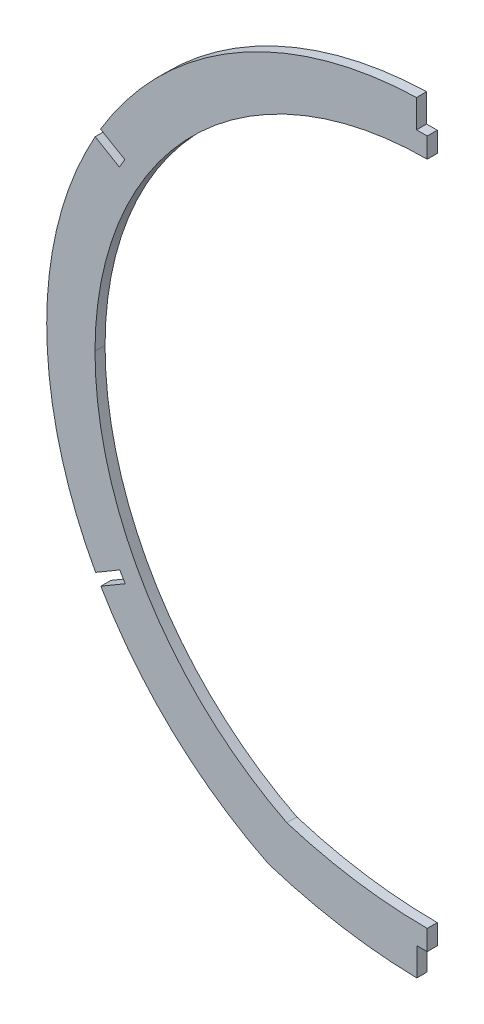
ISO-10303-21;
HEADER;
FILE_DESCRIPTION(('STEP AP214'),'2;1');
FILE_NAME('part.step','',(''),(''),'','','');
FILE_SCHEMA(('AUTOMOTIVE_DESIGN { 1 0 10303 214 1 1 1 1 }'));
ENDSEC;
DATA;
#1=APPLICATION_CONTEXT('core data for automotive mechanical design processes');
#2=APPLICATION_PROTOCOL_DEFINITION('international standard','automotive_design',2000,#1);
#3=PRODUCT_CONTEXT('',#1,'mechanical');
#4=PRODUCT('Part','Part','',(#3));
#5=PRODUCT_RELATED_PRODUCT_CATEGORY('part','',(#4));
#6=PRODUCT_DEFINITION_FORMATION('','',#4);
#7=PRODUCT_DEFINITION_CONTEXT('part definition',#1,'design');
#8=PRODUCT_DEFINITION('design','',#6,#7);
#9=PRODUCT_DEFINITION_SHAPE('','',#8);
#10=(LENGTH_UNIT() NAMED_UNIT(*) SI_UNIT(.MILLI.,.METRE.));
#11=(NAMED_UNIT(*) PLANE_ANGLE_UNIT() SI_UNIT($,.RADIAN.));
#12=(NAMED_UNIT(*) SI_UNIT($,.STERADIAN.) SOLID_ANGLE_UNIT());
#13=UNCERTAINTY_MEASURE_WITH_UNIT(LENGTH_MEASURE(1.E-05),#10,'distance_accuracy_value','');
#14=(GEOMETRIC_REPRESENTATION_CONTEXT(3) GLOBAL_UNCERTAINTY_ASSIGNED_CONTEXT((#13)) GLOBAL_UNIT_ASSIGNED_CONTEXT((#10,
#11,#12)) REPRESENTATION_CONTEXT('',''));
#15=CARTESIAN_POINT('',(0.,0.,0.));
#16=DIRECTION('',(0.,0.,1.));
#17=DIRECTION('',(1.,0.,0.));
#18=AXIS2_PLACEMENT_3D('',#15,#16,#17);
#19=CARTESIAN_POINT('',(2.87745258300709,41.275,1.5875));
#20=DIRECTION('',(0.,0.,1.));
#21=DIRECTION('',(1.,0.,0.));
#22=AXIS2_PLACEMENT_3D('',#19,#20,#21);
#23=PLANE('',#22);
#24=DIRECTION('',(0.,-1.,0.));
#25=VECTOR('',#24,1.);
#26=CARTESIAN_POINT('',(-3.30200000000001,0.,1.5875));
#27=LINE('',#26,#25);
#28=CARTESIAN_POINT('',(-3.30200000000001,-92.624794875824,1.5875));
#29=VERTEX_POINT('',#28);
#30=CARTESIAN_POINT('',(-3.30200000000001,-101.480945567075,1.5875));
#31=VERTEX_POINT('',#30);
#32=EDGE_CURVE('E234',#29,#31,#27,.T.);
#33=ORIENTED_EDGE('',*,*,#32,.F.);
#34=DIRECTION('',(1.,0.,0.));
#35=VECTOR('',#34,1.);
#36=CARTESIAN_POINT('',(0.,-92.624794875824,1.5875));
#37=LINE('',#36,#35);
#38=CARTESIAN_POINT('',(0.,-92.624794875824,1.5875));
#39=VERTEX_POINT('',#38);
#40=EDGE_CURVE('E238',#29,#39,#37,.T.);
#41=ORIENTED_EDGE('',*,*,#40,.T.);
#42=DIRECTION('',(0.,1.,0.));
#43=VECTOR('',#42,1.);
#44=CARTESIAN_POINT('',(0.,41.275,1.5875));
#45=LINE('',#44,#43);
#46=CARTESIAN_POINT('',(0.,-86.2747894878867,1.5875));
#47=VERTEX_POINT('',#46);
#48=EDGE_CURVE('E275',#39,#47,#45,.T.);
#49=ORIENTED_EDGE('',*,*,#48,.T.);
#50=CARTESIAN_POINT('',(0.0401740981522854,63.5,1.5875));
#51=DIRECTION('',(0.,0.,1.));
#52=DIRECTION('',(1.,0.,0.));
#53=AXIS2_PLACEMENT_3D('',#50,#51,#52);
#54=CIRCLE('',#53,149.774794875837);
#55=CARTESIAN_POINT('',(-44.3239593744346,-79.5535313836238,1.5875));
#56=VERTEX_POINT('',#55);
#57=EDGE_CURVE('E280',#56,#47,#54,.T.);
#58=ORIENTED_EDGE('',*,*,#57,.F.);
#59=CARTESIAN_POINT('',(5.71473106786189,19.0500000000001,1.5875));
#60=DIRECTION('',(0.,0.,1.));
#61=DIRECTION('',(1.,0.,0.));
#62=AXIS2_PLACEMENT_3D('',#59,#60,#61);
#63=CIRCLE('',#62,110.573626794554);
#64=CARTESIAN_POINT('',(-104.858895726692,19.05,1.5875));
#65=VERTEX_POINT('',#64);
#66=EDGE_CURVE('E278',#65,#56,#63,.T.);
#67=ORIENTED_EDGE('',*,*,#66,.F.);
#68=CARTESIAN_POINT('',(0.0533981517267298,19.05,1.5875));
#69=DIRECTION('',(0.,0.,1.));
#70=DIRECTION('',(-1.,0.,0.));
#71=AXIS2_PLACEMENT_3D('',#68,#69,#70);
#72=CIRCLE('',#71,104.912293878419);
#73=CARTESIAN_POINT('',(0.,123.962280289149,1.5875));
#74=VERTEX_POINT('',#73);
#75=EDGE_CURVE('E284',#74,#65,#72,.T.);
#76=ORIENTED_EDGE('',*,*,#75,.F.);
#77=CARTESIAN_POINT('',(0.,130.312293878419,1.5875));
#78=VERTEX_POINT('',#77);
#79=EDGE_CURVE('E270',#74,#78,#45,.T.);
#80=ORIENTED_EDGE('',*,*,#79,.T.);
#81=DIRECTION('',(1.,0.,0.));
#82=VECTOR('',#81,1.);
#83=CARTESIAN_POINT('',(0.,130.312293878419,1.5875));
#84=LINE('',#83,#82);
#85=CARTESIAN_POINT('',(-3.3782,130.312293878419,1.5875));
#86=VERTEX_POINT('',#85);
#87=EDGE_CURVE('E198',#86,#78,#84,.T.);
#88=ORIENTED_EDGE('',*,*,#87,.F.);
#89=DIRECTION('',(0.,1.,0.));
#90=VECTOR('',#89,1.);
#91=CARTESIAN_POINT('',(-3.37820000000003,0.,1.5875));
#92=LINE('',#91,#90);
#93=CARTESIAN_POINT('',(-3.3782,139.15327996505,1.5875));
#94=VERTEX_POINT('',#93);
#95=EDGE_CURVE('E179',#86,#94,#92,.T.);
#96=ORIENTED_EDGE('',*,*,#95,.T.);
#97=CARTESIAN_POINT('',(0.0533981517267298,19.05,1.5875));
#98=DIRECTION('',(0.,0.,1.));
#99=DIRECTION('',(-1.,0.,0.));
#100=AXIS2_PLACEMENT_3D('',#97,#98,#99);
#101=CIRCLE('',#100,120.152293878386);
#102=CARTESIAN_POINT('',(-103.109498799884,80.6453765861478,1.5875));
#103=VERTEX_POINT('',#102);
#104=EDGE_CURVE('E309',#94,#103,#101,.T.);
#105=ORIENTED_EDGE('',*,*,#104,.T.);
#106=DIRECTION('',(-0.862448035610578,0.506145617259949,0.));
#107=VECTOR('',#106,1.);
#108=CARTESIAN_POINT('',(8.78872550724226,14.9755698572982,1.5875));
#109=LINE('',#108,#107);
#110=CARTESIAN_POINT('',(-95.4427787347558,76.1460020157409,1.5875));
#111=VERTEX_POINT('',#110);
#112=EDGE_CURVE('E51',#111,#103,#109,.T.);
#113=ORIENTED_EDGE('',*,*,#112,.F.);
#114=DIRECTION('',(-0.50614561725995,-0.862448035610578,0.));
#115=VECTOR('',#114,1.);
#116=CARTESIAN_POINT('',(-104.231504241998,61.1704321584428,1.5875));
#117=LINE('',#116,#115);
#118=CARTESIAN_POINT('',(-97.1526398589833,73.2324800618413,1.5875));
#119=VERTEX_POINT('',#118);
#120=EDGE_CURVE('E206',#111,#119,#117,.T.);
#121=ORIENTED_EDGE('',*,*,#120,.T.);
#122=DIRECTION('',(-0.86244803561058,0.506145617259946,0.));
#123=VECTOR('',#122,1.);
#124=CARTESIAN_POINT('',(7.07886438301491,12.062047903399,1.5875));
#125=LINE('',#124,#123);
#126=CARTESIAN_POINT('',(-104.800401650038,77.7207285737065,1.5875));
#127=VERTEX_POINT('',#126);
#128=EDGE_CURVE('E250',#119,#127,#125,.T.);
#129=ORIENTED_EDGE('',*,*,#128,.T.);
#130=CARTESIAN_POINT('',(-120.098895726659,19.05,1.5875));
#131=VERTEX_POINT('',#130);
#132=EDGE_CURVE('E307',#127,#131,#101,.T.);
#133=ORIENTED_EDGE('',*,*,#132,.T.);
#134=CARTESIAN_POINT('',(5.71473106786189,19.0500000000001,1.5875));
#135=DIRECTION('',(0.,0.,1.));
#136=DIRECTION('',(1.,0.,0.));
#137=AXIS2_PLACEMENT_3D('',#134,#135,#136);
#138=CIRCLE('',#137,125.813626794521);
#139=CARTESIAN_POINT('',(-104.679734985251,-41.3000667111414,1.5875));
#140=VERTEX_POINT('',#139);
#141=EDGE_CURVE('E300',#131,#140,#138,.T.);
#142=ORIENTED_EDGE('',*,*,#141,.T.);
#143=DIRECTION('',(-0.862448043896416,-0.506145603141275,0.));
#144=VECTOR('',#143,1.);
#145=CARTESIAN_POINT('',(-8.78872533830878,14.975570131055,1.5875));
#146=LINE('',#145,#144);
#147=CARTESIAN_POINT('',(-97.0449544512489,-36.8194366887515,1.5875));
#148=VERTEX_POINT('',#147);
#149=EDGE_CURVE('E59',#148,#140,#146,.T.);
#150=ORIENTED_EDGE('',*,*,#149,.F.);
#151=DIRECTION('',(-0.506145603141261,0.862448043896425,0.));
#152=VECTOR('',#151,1.);
#153=CARTESIAN_POINT('',(-88.2562291129412,-51.7950068198052,1.5875));
#154=LINE('',#153,#152);
#155=CARTESIAN_POINT('',(-95.3350933747171,-39.7329586706424,1.5875));
#156=VERTEX_POINT('',#155);
#157=EDGE_CURVE('E220',#156,#148,#154,.T.);
#158=ORIENTED_EDGE('',*,*,#157,.F.);
#159=DIRECTION('',(-0.862448043896416,-0.506145603141276,0.));
#160=VECTOR('',#159,1.);
#161=CARTESIAN_POINT('',(-7.078864261777,12.0620481491642,1.5875));
#162=LINE('',#161,#160);
#163=CARTESIAN_POINT('',(-103.019390963811,-44.2426488084706,1.5875));
#164=VERTEX_POINT('',#163);
#165=EDGE_CURVE('E217',#156,#164,#162,.T.);
#166=ORIENTED_EDGE('',*,*,#165,.T.);
#167=CARTESIAN_POINT('',(-50.0584032460589,-93.7259999999829,1.5875));
#168=VERTEX_POINT('',#167);
#169=EDGE_CURVE('E304',#164,#168,#138,.T.);
#170=ORIENTED_EDGE('',*,*,#169,.T.);
#171=CARTESIAN_POINT('',(0.0401740981522854,63.5,1.5875));
#172=DIRECTION('',(0.,0.,1.));
#173=DIRECTION('',(1.,0.,0.));
#174=AXIS2_PLACEMENT_3D('',#171,#172,#173);
#175=CIRCLE('',#174,165.014794875819);
#176=EDGE_CURVE('E303',#168,#31,#175,.T.);
#177=ORIENTED_EDGE('',*,*,#176,.T.);
#178=EDGE_LOOP('',(#33,#41,#49,#58,#67,#76,#80,#88,#96,#105,#113,#121,#129,#133,#142,#150,#158,
#166,#170,#177));
#179=FACE_BOUND('',#178,.T.);
#180=ADVANCED_FACE('F36',(#179),#23,.T.);
#181=CARTESIAN_POINT('',(2.87745258300709,41.275,-1.5875));
#182=DIRECTION('',(0.,0.,1.));
#183=DIRECTION('',(1.,0.,0.));
#184=AXIS2_PLACEMENT_3D('',#181,#182,#183);
#185=PLANE('',#184);
#186=DIRECTION('',(1.,0.,0.));
#187=VECTOR('',#186,1.);
#188=CARTESIAN_POINT('',(0.,-92.624794875824,-1.5875));
#189=LINE('',#188,#187);
#190=CARTESIAN_POINT('',(-3.30200000000001,-92.624794875824,-1.5875));
#191=VERTEX_POINT('',#190);
#192=CARTESIAN_POINT('',(0.,-92.624794875824,-1.5875));
#193=VERTEX_POINT('',#192);
#194=EDGE_CURVE('E231',#191,#193,#189,.T.);
#195=ORIENTED_EDGE('',*,*,#194,.F.);
#196=DIRECTION('',(0.,-1.,0.));
#197=VECTOR('',#196,1.);
#198=CARTESIAN_POINT('',(-3.30200000000001,0.,-1.5875));
#199=LINE('',#198,#197);
#200=CARTESIAN_POINT('',(-3.30200000000001,-101.480945567075,-1.5875));
#201=VERTEX_POINT('',#200);
#202=EDGE_CURVE('E233',#191,#201,#199,.T.);
#203=ORIENTED_EDGE('',*,*,#202,.T.);
#204=CARTESIAN_POINT('',(0.0401740981522854,63.5,-1.5875));
#205=DIRECTION('',(0.,0.,1.));
#206=DIRECTION('',(1.,0.,0.));
#207=AXIS2_PLACEMENT_3D('',#204,#205,#206);
#208=CIRCLE('',#207,165.014794875819);
#209=CARTESIAN_POINT('',(-50.0584032460589,-93.7259999999829,-1.5875));
#210=VERTEX_POINT('',#209);
#211=EDGE_CURVE('E313',#210,#201,#208,.T.);
#212=ORIENTED_EDGE('',*,*,#211,.F.);
#213=CARTESIAN_POINT('',(5.71473106786189,19.0500000000001,-1.5875));
#214=DIRECTION('',(0.,0.,1.));
#215=DIRECTION('',(1.,0.,0.));
#216=AXIS2_PLACEMENT_3D('',#213,#214,#215);
#217=CIRCLE('',#216,125.813626794521);
#218=CARTESIAN_POINT('',(-103.019390963811,-44.2426488084706,-1.5875));
#219=VERTEX_POINT('',#218);
#220=EDGE_CURVE('E299',#219,#210,#217,.T.);
#221=ORIENTED_EDGE('',*,*,#220,.F.);
#222=DIRECTION('',(-0.862448043896416,-0.506145603141276,0.));
#223=VECTOR('',#222,1.);
#224=CARTESIAN_POINT('',(-7.078864261777,12.0620481491642,-1.5875));
#225=LINE('',#224,#223);
#226=CARTESIAN_POINT('',(-95.3350933747171,-39.7329586706424,-1.5875));
#227=VERTEX_POINT('',#226);
#228=EDGE_CURVE('E208',#227,#219,#225,.T.);
#229=ORIENTED_EDGE('',*,*,#228,.F.);
#230=DIRECTION('',(-0.506145603141261,0.862448043896425,0.));
#231=VECTOR('',#230,1.);
#232=CARTESIAN_POINT('',(-88.2562291129412,-51.7950068198052,-1.5875));
#233=LINE('',#232,#231);
#234=CARTESIAN_POINT('',(-97.0449544512489,-36.8194366887515,-1.5875));
#235=VERTEX_POINT('',#234);
#236=EDGE_CURVE('E210',#227,#235,#233,.T.);
#237=ORIENTED_EDGE('',*,*,#236,.T.);
#238=DIRECTION('',(-0.862448043896416,-0.506145603141275,0.));
#239=VECTOR('',#238,1.);
#240=CARTESIAN_POINT('',(-8.78872533830878,14.975570131055,-1.5875));
#241=LINE('',#240,#239);
#242=CARTESIAN_POINT('',(-104.679734985251,-41.3000667111414,-1.5875));
#243=VERTEX_POINT('',#242);
#244=EDGE_CURVE('E213',#235,#243,#241,.T.);
#245=ORIENTED_EDGE('',*,*,#244,.T.);
#246=CARTESIAN_POINT('',(-120.098895726659,19.05,-1.5875));
#247=VERTEX_POINT('',#246);
#248=EDGE_CURVE('E310',#247,#243,#217,.T.);
#249=ORIENTED_EDGE('',*,*,#248,.F.);
#250=CARTESIAN_POINT('',(0.0533981517267298,19.05,-1.5875));
#251=DIRECTION('',(0.,0.,1.));
#252=DIRECTION('',(-1.,0.,0.));
#253=AXIS2_PLACEMENT_3D('',#250,#251,#252);
#254=CIRCLE('',#253,120.152293878386);
#255=CARTESIAN_POINT('',(-104.800401650038,77.7207285737065,-1.5875));
#256=VERTEX_POINT('',#255);
#257=EDGE_CURVE('E316',#256,#247,#254,.T.);
#258=ORIENTED_EDGE('',*,*,#257,.F.);
#259=DIRECTION('',(-0.86244803561058,0.506145617259946,0.));
#260=VECTOR('',#259,1.);
#261=CARTESIAN_POINT('',(7.07886438301491,12.062047903399,-1.5875));
#262=LINE('',#261,#260);
#263=CARTESIAN_POINT('',(-97.1526398589833,73.2324800618413,-1.5875));
#264=VERTEX_POINT('',#263);
#265=EDGE_CURVE('E252',#264,#256,#262,.T.);
#266=ORIENTED_EDGE('',*,*,#265,.F.);
#267=DIRECTION('',(-0.50614561725995,-0.862448035610578,0.));
#268=VECTOR('',#267,1.);
#269=CARTESIAN_POINT('',(-104.231504241998,61.1704321584428,-1.5875));
#270=LINE('',#269,#268);
#271=CARTESIAN_POINT('',(-95.4427787347558,76.1460020157409,-1.5875));
#272=VERTEX_POINT('',#271);
#273=EDGE_CURVE('E247',#272,#264,#270,.T.);
#274=ORIENTED_EDGE('',*,*,#273,.F.);
#275=DIRECTION('',(-0.862448035610578,0.506145617259949,0.));
#276=VECTOR('',#275,1.);
#277=CARTESIAN_POINT('',(8.78872550724226,14.9755698572982,-1.5875));
#278=LINE('',#277,#276);
#279=CARTESIAN_POINT('',(-103.109498799884,80.6453765861478,-1.5875));
#280=VERTEX_POINT('',#279);
#281=EDGE_CURVE('E249',#272,#280,#278,.T.);
#282=ORIENTED_EDGE('',*,*,#281,.T.);
#283=CARTESIAN_POINT('',(-3.3782,139.15327996505,-1.5875));
#284=VERTEX_POINT('',#283);
#285=EDGE_CURVE('E197',#284,#280,#254,.T.);
#286=ORIENTED_EDGE('',*,*,#285,.F.);
#287=DIRECTION('',(0.,1.,0.));
#288=VECTOR('',#287,1.);
#289=CARTESIAN_POINT('',(-3.37820000000003,0.,-1.5875));
#290=LINE('',#289,#288);
#291=CARTESIAN_POINT('',(-3.3782,130.312293878419,-1.5875));
#292=VERTEX_POINT('',#291);
#293=EDGE_CURVE('E176',#292,#284,#290,.T.);
#294=ORIENTED_EDGE('',*,*,#293,.F.);
#295=DIRECTION('',(1.,0.,0.));
#296=VECTOR('',#295,1.);
#297=CARTESIAN_POINT('',(0.,130.312293878419,-1.5875));
#298=LINE('',#297,#296);
#299=CARTESIAN_POINT('',(0.,130.312293878419,-1.5875));
#300=VERTEX_POINT('',#299);
#301=EDGE_CURVE('E183',#292,#300,#298,.T.);
#302=ORIENTED_EDGE('',*,*,#301,.T.);
#303=DIRECTION('',(0.,1.,0.));
#304=VECTOR('',#303,1.);
#305=CARTESIAN_POINT('',(0.,41.275,-1.5875));
#306=LINE('',#305,#304);
#307=CARTESIAN_POINT('',(0.,123.962280289149,-1.5875));
#308=VERTEX_POINT('',#307);
#309=EDGE_CURVE('E263',#308,#300,#306,.T.);
#310=ORIENTED_EDGE('',*,*,#309,.F.);
#311=CARTESIAN_POINT('',(0.0533981517267298,19.05,-1.5875));
#312=DIRECTION('',(0.,0.,1.));
#313=DIRECTION('',(-1.,0.,0.));
#314=AXIS2_PLACEMENT_3D('',#311,#312,#313);
#315=CIRCLE('',#314,104.912293878419);
#316=CARTESIAN_POINT('',(-104.858895726692,19.05,-1.5875));
#317=VERTEX_POINT('',#316);
#318=EDGE_CURVE('E281',#308,#317,#315,.T.);
#319=ORIENTED_EDGE('',*,*,#318,.T.);
#320=CARTESIAN_POINT('',(5.71473106786189,19.0500000000001,-1.5875));
#321=DIRECTION('',(0.,0.,1.));
#322=DIRECTION('',(1.,0.,0.));
#323=AXIS2_PLACEMENT_3D('',#320,#321,#322);
#324=CIRCLE('',#323,110.573626794554);
#325=CARTESIAN_POINT('',(-44.3239593744346,-79.5535313836238,-1.5875));
#326=VERTEX_POINT('',#325);
#327=EDGE_CURVE('E287',#317,#326,#324,.T.);
#328=ORIENTED_EDGE('',*,*,#327,.T.);
#329=CARTESIAN_POINT('',(0.0401740981522854,63.5,-1.5875));
#330=DIRECTION('',(0.,0.,1.));
#331=DIRECTION('',(1.,0.,0.));
#332=AXIS2_PLACEMENT_3D('',#329,#330,#331);
#333=CIRCLE('',#332,149.774794875837);
#334=CARTESIAN_POINT('',(0.,-86.2747894878867,-1.5875));
#335=VERTEX_POINT('',#334);
#336=EDGE_CURVE('E290',#326,#335,#333,.T.);
#337=ORIENTED_EDGE('',*,*,#336,.T.);
#338=EDGE_CURVE('E271',#193,#335,#306,.T.);
#339=ORIENTED_EDGE('',*,*,#338,.F.);
#340=EDGE_LOOP('',(#195,#203,#212,#221,#229,#237,#245,#249,#258,#266,#274,#282,#286,#294,#302,
#310,#319,#328,#337,#339));
#341=FACE_BOUND('',#340,.T.);
#342=ADVANCED_FACE('F194',(#341),#185,.F.);
#343=CARTESIAN_POINT('',(0.0533981517267298,19.05,1.5875));
#344=DIRECTION('',(0.,0.,-1.));
#345=DIRECTION('',(-1.,0.,0.));
#346=AXIS2_PLACEMENT_3D('',#343,#344,#345);
#347=CYLINDRICAL_SURFACE('',#346,120.152293878386);
#348=DIRECTION('',(0.,0.,1.));
#349=VECTOR('',#348,1.);
#350=CARTESIAN_POINT('',(-3.3782,139.15327996505,-1.5875));
#351=LINE('',#350,#349);
#352=EDGE_CURVE('E204',#284,#94,#351,.T.);
#353=ORIENTED_EDGE('',*,*,#352,.F.);
#354=ORIENTED_EDGE('',*,*,#285,.T.);
#355=DIRECTION('',(0.,0.,1.));
#356=VECTOR('',#355,1.);
#357=CARTESIAN_POINT('',(-103.109498799884,80.6453765861478,-1.5875));
#358=LINE('',#357,#356);
#359=EDGE_CURVE('E266',#280,#103,#358,.T.);
#360=ORIENTED_EDGE('',*,*,#359,.T.);
#361=ORIENTED_EDGE('',*,*,#104,.F.);
#362=EDGE_LOOP('',(#353,#354,#360,#361));
#363=FACE_BOUND('',#362,.T.);
#364=ADVANCED_FACE('F342',(#363),#347,.T.);
#365=DIRECTION('',(0.,0.,1.));
#366=VECTOR('',#365,1.);
#367=CARTESIAN_POINT('',(-104.800401650038,77.7207285737065,-1.5875));
#368=LINE('',#367,#366);
#369=EDGE_CURVE('E264',#256,#127,#368,.T.);
#370=ORIENTED_EDGE('',*,*,#369,.F.);
#371=ORIENTED_EDGE('',*,*,#257,.T.);
#372=DIRECTION('',(0.,0.,-1.));
#373=VECTOR('',#372,1.);
#374=CARTESIAN_POINT('',(-120.098895726659,19.05,1.5875));
#375=LINE('',#374,#373);
#376=EDGE_CURVE('E318',#131,#247,#375,.T.);
#377=ORIENTED_EDGE('',*,*,#376,.F.);
#378=ORIENTED_EDGE('',*,*,#132,.F.);
#379=EDGE_LOOP('',(#370,#371,#377,#378));
#380=FACE_BOUND('',#379,.T.);
#381=ADVANCED_FACE('F386',(#380),#347,.T.);
#382=CARTESIAN_POINT('',(5.71473106786189,19.0500000000001,1.5875));
#383=DIRECTION('',(0.,0.,-1.));
#384=DIRECTION('',(-1.,0.,0.));
#385=AXIS2_PLACEMENT_3D('',#382,#383,#384);
#386=CYLINDRICAL_SURFACE('',#385,125.813626794521);
#387=DIRECTION('',(0.,0.,1.));
#388=VECTOR('',#387,1.);
#389=CARTESIAN_POINT('',(-103.019390963811,-44.2426488084706,-1.5875));
#390=LINE('',#389,#388);
#391=EDGE_CURVE('E202',#219,#164,#390,.T.);
#392=ORIENTED_EDGE('',*,*,#391,.F.);
#393=ORIENTED_EDGE('',*,*,#220,.T.);
#394=DIRECTION('',(0.,0.,-1.));
#395=VECTOR('',#394,1.);
#396=CARTESIAN_POINT('',(-50.0584032460589,-93.7259999999829,1.5875));
#397=LINE('',#396,#395);
#398=EDGE_CURVE('E44',#168,#210,#397,.T.);
#399=ORIENTED_EDGE('',*,*,#398,.F.);
#400=ORIENTED_EDGE('',*,*,#169,.F.);
#401=EDGE_LOOP('',(#392,#393,#399,#400));
#402=FACE_BOUND('',#401,.T.);
#403=ADVANCED_FACE('F329',(#402),#386,.T.);
#404=CARTESIAN_POINT('',(0.,0.,0.));
#405=DIRECTION('',(1.,0.,0.));
#406=DIRECTION('',(0.,0.,-1.));
#407=AXIS2_PLACEMENT_3D('',#404,#405,#406);
#408=PLANE('',#407);
#409=ORIENTED_EDGE('',*,*,#48,.F.);
#410=DIRECTION('',(0.,0.,1.));
#411=VECTOR('',#410,1.);
#412=CARTESIAN_POINT('',(0.,-92.624794875824,-1.5875));
#413=LINE('',#412,#411);
#414=EDGE_CURVE('E221',#193,#39,#413,.T.);
#415=ORIENTED_EDGE('',*,*,#414,.F.);
#416=ORIENTED_EDGE('',*,*,#338,.T.);
#417=DIRECTION('',(0.,0.,-1.));
#418=VECTOR('',#417,1.);
#419=CARTESIAN_POINT('',(0.,-86.2747894878867,1.5875));
#420=LINE('',#419,#418);
#421=EDGE_CURVE('E274',#47,#335,#420,.T.);
#422=ORIENTED_EDGE('',*,*,#421,.F.);
#423=EDGE_LOOP('',(#409,#415,#416,#422));
#424=FACE_BOUND('',#423,.T.);
#425=ADVANCED_FACE('F364',(#424),#408,.T.);
#426=CARTESIAN_POINT('',(0.0401740981522854,63.5,1.5875));
#427=DIRECTION('',(0.,0.,-1.));
#428=DIRECTION('',(-1.,0.,0.));
#429=AXIS2_PLACEMENT_3D('',#426,#427,#428);
#430=CYLINDRICAL_SURFACE('',#429,165.014794875819);
#431=ORIENTED_EDGE('',*,*,#211,.T.);
#432=DIRECTION('',(0.,0.,1.));
#433=VECTOR('',#432,1.);
#434=CARTESIAN_POINT('',(-3.30200000000001,-101.480945567075,-1.5875));
#435=LINE('',#434,#433);
#436=EDGE_CURVE('E243',#201,#31,#435,.T.);
#437=ORIENTED_EDGE('',*,*,#436,.T.);
#438=ORIENTED_EDGE('',*,*,#176,.F.);
#439=ORIENTED_EDGE('',*,*,#398,.T.);
#440=EDGE_LOOP('',(#431,#437,#438,#439));
#441=FACE_BOUND('',#440,.T.);
#442=ADVANCED_FACE('F324',(#441),#430,.T.);
#443=CARTESIAN_POINT('',(0.0401740981522854,63.5,1.5875));
#444=DIRECTION('',(0.,0.,-1.));
#445=DIRECTION('',(-1.,0.,0.));
#446=AXIS2_PLACEMENT_3D('',#443,#444,#445);
#447=CYLINDRICAL_SURFACE('',#446,149.774794875837);
#448=ORIENTED_EDGE('',*,*,#57,.T.);
#449=ORIENTED_EDGE('',*,*,#421,.T.);
#450=ORIENTED_EDGE('',*,*,#336,.F.);
#451=DIRECTION('',(0.,0.,-1.));
#452=VECTOR('',#451,1.);
#453=CARTESIAN_POINT('',(-44.3239593744346,-79.5535313836238,1.5875));
#454=LINE('',#453,#452);
#455=EDGE_CURVE('E296',#56,#326,#454,.T.);
#456=ORIENTED_EDGE('',*,*,#455,.F.);
#457=EDGE_LOOP('',(#448,#449,#450,#456));
#458=FACE_BOUND('',#457,.T.);
#459=ADVANCED_FACE('F361',(#458),#447,.F.);
#460=CARTESIAN_POINT('',(0.0533981517267298,19.05,1.5875));
#461=DIRECTION('',(0.,0.,-1.));
#462=DIRECTION('',(-1.,0.,0.));
#463=AXIS2_PLACEMENT_3D('',#460,#461,#462);
#464=CYLINDRICAL_SURFACE('',#463,104.912293878419);
#465=ORIENTED_EDGE('',*,*,#318,.F.);
#466=DIRECTION('',(0.,0.,-1.));
#467=VECTOR('',#466,1.);
#468=CARTESIAN_POINT('',(0.,123.962280289149,1.5875));
#469=LINE('',#468,#467);
#470=EDGE_CURVE('E11',#308,#74,#469,.F.);
#471=ORIENTED_EDGE('',*,*,#470,.T.);
#472=ORIENTED_EDGE('',*,*,#75,.T.);
#473=DIRECTION('',(0.,0.,-1.));
#474=VECTOR('',#473,1.);
#475=CARTESIAN_POINT('',(-104.858895726692,19.05,1.5875));
#476=LINE('',#475,#474);
#477=EDGE_CURVE('E286',#65,#317,#476,.T.);
#478=ORIENTED_EDGE('',*,*,#477,.T.);
#479=EDGE_LOOP('',(#465,#471,#472,#478));
#480=FACE_BOUND('',#479,.T.);
#481=ADVANCED_FACE('F351',(#480),#464,.F.);
#482=ORIENTED_EDGE('',*,*,#248,.T.);
#483=DIRECTION('',(0.,0.,1.));
#484=VECTOR('',#483,1.);
#485=CARTESIAN_POINT('',(-104.679734985251,-41.3000667111414,-1.5875));
#486=LINE('',#485,#484);
#487=EDGE_CURVE('E226',#243,#140,#486,.T.);
#488=ORIENTED_EDGE('',*,*,#487,.T.);
#489=ORIENTED_EDGE('',*,*,#141,.F.);
#490=ORIENTED_EDGE('',*,*,#376,.T.);
#491=EDGE_LOOP('',(#482,#488,#489,#490));
#492=FACE_BOUND('',#491,.T.);
#493=ADVANCED_FACE('F38',(#492),#386,.T.);
#494=CARTESIAN_POINT('',(5.71473106786189,19.0500000000001,1.5875));
#495=DIRECTION('',(0.,0.,-1.));
#496=DIRECTION('',(-1.,0.,0.));
#497=AXIS2_PLACEMENT_3D('',#494,#495,#496);
#498=CYLINDRICAL_SURFACE('',#497,110.573626794554);
#499=ORIENTED_EDGE('',*,*,#327,.F.);
#500=ORIENTED_EDGE('',*,*,#477,.F.);
#501=ORIENTED_EDGE('',*,*,#66,.T.);
#502=ORIENTED_EDGE('',*,*,#455,.T.);
#503=EDGE_LOOP('',(#499,#500,#501,#502));
#504=FACE_BOUND('',#503,.T.);
#505=ADVANCED_FACE('F355',(#504),#498,.F.);
#506=DIRECTION('',(0.,0.,1.));
#507=VECTOR('',#506,1.);
#508=CARTESIAN_POINT('',(0.,130.312293878419,-1.5875));
#509=LINE('',#508,#507);
#510=EDGE_CURVE('E182',#300,#78,#509,.T.);
#511=ORIENTED_EDGE('',*,*,#510,.T.);
#512=ORIENTED_EDGE('',*,*,#79,.F.);
#513=ORIENTED_EDGE('',*,*,#470,.F.);
#514=ORIENTED_EDGE('',*,*,#309,.T.);
#515=EDGE_LOOP('',(#511,#512,#513,#514));
#516=FACE_BOUND('',#515,.T.);
#517=ADVANCED_FACE('F347',(#516),#408,.T.);
#518=CARTESIAN_POINT('',(0.,-92.624794875824,-1.5875));
#519=DIRECTION('',(0.,-1.,0.));
#520=DIRECTION('',(0.,0.,-1.));
#521=AXIS2_PLACEMENT_3D('',#518,#519,#520);
#522=PLANE('',#521);
#523=ORIENTED_EDGE('',*,*,#40,.F.);
#524=DIRECTION('',(0.,0.,1.));
#525=VECTOR('',#524,1.);
#526=CARTESIAN_POINT('',(-3.30200000000001,-92.624794875824,-1.5875));
#527=LINE('',#526,#525);
#528=EDGE_CURVE('E237',#191,#29,#527,.T.);
#529=ORIENTED_EDGE('',*,*,#528,.F.);
#530=ORIENTED_EDGE('',*,*,#194,.T.);
#531=ORIENTED_EDGE('',*,*,#414,.T.);
#532=EDGE_LOOP('',(#523,#529,#530,#531));
#533=FACE_BOUND('',#532,.T.);
#534=ADVANCED_FACE('F366',(#533),#522,.T.);
#535=CARTESIAN_POINT('',(-3.30200000000001,0.,-1.5875));
#536=DIRECTION('',(-1.,0.,0.));
#537=DIRECTION('',(0.,-1.,0.));
#538=AXIS2_PLACEMENT_3D('',#535,#536,#537);
#539=PLANE('',#538);
#540=ORIENTED_EDGE('',*,*,#32,.T.);
#541=ORIENTED_EDGE('',*,*,#436,.F.);
#542=ORIENTED_EDGE('',*,*,#202,.F.);
#543=ORIENTED_EDGE('',*,*,#528,.T.);
#544=EDGE_LOOP('',(#540,#541,#542,#543));
#545=FACE_BOUND('',#544,.T.);
#546=ADVANCED_FACE('F335',(#545),#539,.F.);
#547=CARTESIAN_POINT('',(-3.37820000000003,0.,-1.5875));
#548=DIRECTION('',(1.,0.,0.));
#549=DIRECTION('',(0.,1.,0.));
#550=AXIS2_PLACEMENT_3D('',#547,#548,#549);
#551=PLANE('',#550);
#552=ORIENTED_EDGE('',*,*,#95,.F.);
#553=DIRECTION('',(0.,0.,1.));
#554=VECTOR('',#553,1.);
#555=CARTESIAN_POINT('',(-3.3782,130.312293878419,-1.5875));
#556=LINE('',#555,#554);
#557=EDGE_CURVE('E172',#292,#86,#556,.T.);
#558=ORIENTED_EDGE('',*,*,#557,.F.);
#559=ORIENTED_EDGE('',*,*,#293,.T.);
#560=ORIENTED_EDGE('',*,*,#352,.T.);
#561=EDGE_LOOP('',(#552,#558,#559,#560));
#562=FACE_BOUND('',#561,.T.);
#563=ADVANCED_FACE('F174',(#562),#551,.T.);
#564=CARTESIAN_POINT('',(0.,130.312293878419,-1.5875));
#565=DIRECTION('',(0.,-1.,0.));
#566=DIRECTION('',(0.,0.,-1.));
#567=AXIS2_PLACEMENT_3D('',#564,#565,#566);
#568=PLANE('',#567);
#569=ORIENTED_EDGE('',*,*,#87,.T.);
#570=ORIENTED_EDGE('',*,*,#510,.F.);
#571=ORIENTED_EDGE('',*,*,#301,.F.);
#572=ORIENTED_EDGE('',*,*,#557,.T.);
#573=EDGE_LOOP('',(#569,#570,#571,#572));
#574=FACE_BOUND('',#573,.T.);
#575=ADVANCED_FACE('F186',(#574),#568,.F.);
#576=CARTESIAN_POINT('',(-7.078864261777,12.0620481491642,-1.5875));
#577=DIRECTION('',(-0.506145603141276,0.862448043896416,0.));
#578=DIRECTION('',(-0.862448043896416,-0.506145603141276,0.));
#579=AXIS2_PLACEMENT_3D('',#576,#577,#578);
#580=PLANE('',#579);
#581=ORIENTED_EDGE('',*,*,#165,.F.);
#582=DIRECTION('',(0.,0.,1.));
#583=VECTOR('',#582,1.);
#584=CARTESIAN_POINT('',(-95.3350933747171,-39.7329586706424,-1.5875));
#585=LINE('',#584,#583);
#586=EDGE_CURVE('E216',#227,#156,#585,.T.);
#587=ORIENTED_EDGE('',*,*,#586,.F.);
#588=ORIENTED_EDGE('',*,*,#228,.T.);
#589=ORIENTED_EDGE('',*,*,#391,.T.);
#590=EDGE_LOOP('',(#581,#587,#588,#589));
#591=FACE_BOUND('',#590,.T.);
#592=ADVANCED_FACE('F442',(#591),#580,.T.);
#593=CARTESIAN_POINT('',(-8.78872533830878,14.975570131055,-1.5875));
#594=DIRECTION('',(-0.506145603141275,0.862448043896416,0.));
#595=DIRECTION('',(-0.862448043896416,-0.506145603141275,0.));
#596=AXIS2_PLACEMENT_3D('',#593,#594,#595);
#597=PLANE('',#596);
#598=ORIENTED_EDGE('',*,*,#149,.T.);
#599=ORIENTED_EDGE('',*,*,#487,.F.);
#600=ORIENTED_EDGE('',*,*,#244,.F.);
#601=DIRECTION('',(0.,0.,1.));
#602=VECTOR('',#601,1.);
#603=CARTESIAN_POINT('',(-97.0449544512489,-36.8194366887515,-1.5875));
#604=LINE('',#603,#602);
#605=EDGE_CURVE('E228',#235,#148,#604,.T.);
#606=ORIENTED_EDGE('',*,*,#605,.T.);
#607=EDGE_LOOP('',(#598,#599,#600,#606));
#608=FACE_BOUND('',#607,.T.);
#609=ADVANCED_FACE('F414',(#608),#597,.F.);
#610=CARTESIAN_POINT('',(-88.2562291129412,-51.7950068198052,-1.5875));
#611=DIRECTION('',(0.862448043896425,0.506145603141261,0.));
#612=DIRECTION('',(-0.506145603141261,0.862448043896425,0.));
#613=AXIS2_PLACEMENT_3D('',#610,#611,#612);
#614=PLANE('',#613);
#615=ORIENTED_EDGE('',*,*,#157,.T.);
#616=ORIENTED_EDGE('',*,*,#605,.F.);
#617=ORIENTED_EDGE('',*,*,#236,.F.);
#618=ORIENTED_EDGE('',*,*,#586,.T.);
#619=EDGE_LOOP('',(#615,#616,#617,#618));
#620=FACE_BOUND('',#619,.T.);
#621=ADVANCED_FACE('F416',(#620),#614,.F.);
#622=CARTESIAN_POINT('',(-104.231504241998,61.1704321584428,-1.5875));
#623=DIRECTION('',(-0.862448035610578,0.50614561725995,0.));
#624=DIRECTION('',(-0.50614561725995,-0.862448035610578,0.));
#625=AXIS2_PLACEMENT_3D('',#622,#623,#624);
#626=PLANE('',#625);
#627=ORIENTED_EDGE('',*,*,#120,.F.);
#628=DIRECTION('',(0.,0.,1.));
#629=VECTOR('',#628,1.);
#630=CARTESIAN_POINT('',(-95.4427787347558,76.1460020157409,-1.5875));
#631=LINE('',#630,#629);
#632=EDGE_CURVE('E254',#272,#111,#631,.T.);
#633=ORIENTED_EDGE('',*,*,#632,.F.);
#634=ORIENTED_EDGE('',*,*,#273,.T.);
#635=DIRECTION('',(0.,0.,1.));
#636=VECTOR('',#635,1.);
#637=CARTESIAN_POINT('',(-97.1526398589833,73.2324800618413,-1.5875));
#638=LINE('',#637,#636);
#639=EDGE_CURVE('E260',#264,#119,#638,.T.);
#640=ORIENTED_EDGE('',*,*,#639,.T.);
#641=EDGE_LOOP('',(#627,#633,#634,#640));
#642=FACE_BOUND('',#641,.T.);
#643=ADVANCED_FACE('F397',(#642),#626,.T.);
#644=CARTESIAN_POINT('',(7.07886438301491,12.062047903399,-1.5875));
#645=DIRECTION('',(0.506145617259946,0.86244803561058,0.));
#646=DIRECTION('',(-0.86244803561058,0.506145617259946,0.));
#647=AXIS2_PLACEMENT_3D('',#644,#645,#646);
#648=PLANE('',#647);
#649=ORIENTED_EDGE('',*,*,#128,.F.);
#650=ORIENTED_EDGE('',*,*,#639,.F.);
#651=ORIENTED_EDGE('',*,*,#265,.T.);
#652=ORIENTED_EDGE('',*,*,#369,.T.);
#653=EDGE_LOOP('',(#649,#650,#651,#652));
#654=FACE_BOUND('',#653,.T.);
#655=ADVANCED_FACE('F421',(#654),#648,.T.);
#656=CARTESIAN_POINT('',(8.78872550724226,14.9755698572982,-1.5875));
#657=DIRECTION('',(0.506145617259949,0.862448035610578,0.));
#658=DIRECTION('',(-0.862448035610578,0.506145617259949,0.));
#659=AXIS2_PLACEMENT_3D('',#656,#657,#658);
#660=PLANE('',#659);
#661=ORIENTED_EDGE('',*,*,#112,.T.);
#662=ORIENTED_EDGE('',*,*,#359,.F.);
#663=ORIENTED_EDGE('',*,*,#281,.F.);
#664=ORIENTED_EDGE('',*,*,#632,.T.);
#665=EDGE_LOOP('',(#661,#662,#663,#664));
#666=FACE_BOUND('',#665,.T.);
#667=ADVANCED_FACE('F427',(#666),#660,.F.);
#668=CLOSED_SHELL('',(#180,#342,#364,#381,#403,#425,#442,#459,#481,#493,#505,#517,#534,#546,
#563,#575,#592,#609,#621,#643,#655,#667));
#669=MANIFOLD_SOLID_BREP('B2',#668);
#670=ADVANCED_BREP_SHAPE_REPRESENTATION('',(#18,#669),#14);
#671=SHAPE_DEFINITION_REPRESENTATION(#9,#670);
ENDSEC;
END-ISO-10303-21;
